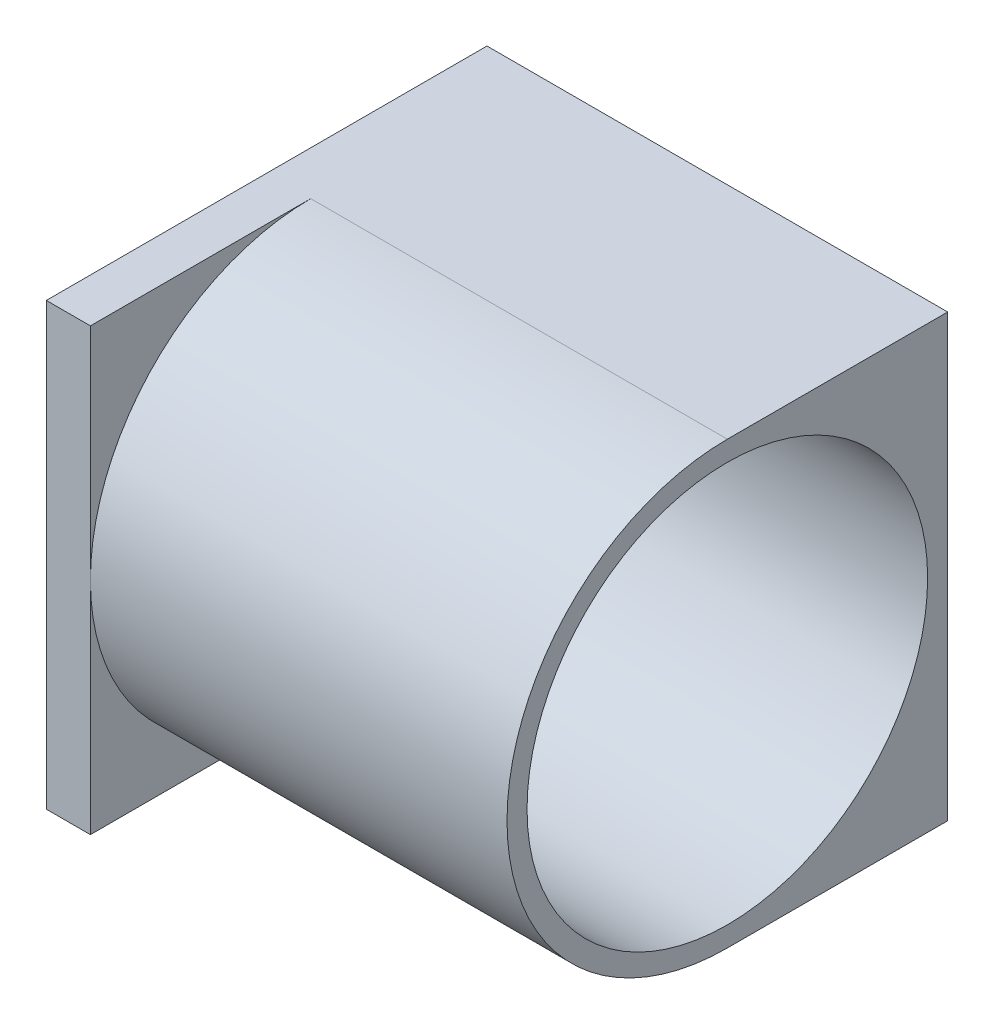
ISO-10303-21;
HEADER;
FILE_DESCRIPTION(('STEP AP214'),'2;1');
FILE_NAME('part.step','',(''),(''),'','','');
FILE_SCHEMA(('AUTOMOTIVE_DESIGN { 1 0 10303 214 1 1 1 1 }'));
ENDSEC;
DATA;
#1=APPLICATION_CONTEXT('core data for automotive mechanical design processes');
#2=APPLICATION_PROTOCOL_DEFINITION('international standard','automotive_design',2000,#1);
#3=PRODUCT_CONTEXT('',#1,'mechanical');
#4=PRODUCT('Part','Part','',(#3));
#5=PRODUCT_RELATED_PRODUCT_CATEGORY('part','',(#4));
#6=PRODUCT_DEFINITION_FORMATION('','',#4);
#7=PRODUCT_DEFINITION_CONTEXT('part definition',#1,'design');
#8=PRODUCT_DEFINITION('design','',#6,#7);
#9=PRODUCT_DEFINITION_SHAPE('','',#8);
#10=(LENGTH_UNIT() NAMED_UNIT(*) SI_UNIT(.MILLI.,.METRE.));
#11=(NAMED_UNIT(*) PLANE_ANGLE_UNIT() SI_UNIT($,.RADIAN.));
#12=(NAMED_UNIT(*) SI_UNIT($,.STERADIAN.) SOLID_ANGLE_UNIT());
#13=UNCERTAINTY_MEASURE_WITH_UNIT(LENGTH_MEASURE(1.E-05),#10,'distance_accuracy_value','');
#14=(GEOMETRIC_REPRESENTATION_CONTEXT(3) GLOBAL_UNCERTAINTY_ASSIGNED_CONTEXT((#13)) GLOBAL_UNIT_ASSIGNED_CONTEXT((#10,
#11,#12)) REPRESENTATION_CONTEXT('',''));
#15=CARTESIAN_POINT('',(0.,0.,0.));
#16=DIRECTION('',(0.,0.,1.));
#17=DIRECTION('',(1.,0.,0.));
#18=AXIS2_PLACEMENT_3D('',#15,#16,#17);
#19=CARTESIAN_POINT('',(0.,0.,0.));
#20=DIRECTION('',(1.,0.,0.));
#21=DIRECTION('',(0.,1.,0.));
#22=AXIS2_PLACEMENT_3D('',#19,#20,#21);
#23=PLANE('',#22);
#24=CARTESIAN_POINT('',(0.,0.,0.));
#25=DIRECTION('',(-1.,0.,0.));
#26=DIRECTION('',(0.,-1.,0.));
#27=AXIS2_PLACEMENT_3D('',#24,#25,#26);
#28=CIRCLE('',#27,50.);
#29=CARTESIAN_POINT('',(0.,50.,0.));
#30=VERTEX_POINT('',#29);
#31=EDGE_CURVE('E20',#30,#30,#28,.T.);
#32=ORIENTED_EDGE('',*,*,#31,.F.);
#33=EDGE_LOOP('',(#32));
#34=FACE_BOUND('',#33,.T.);
#35=DIRECTION('',(0.,0.,1.));
#36=VECTOR('',#35,1.);
#37=CARTESIAN_POINT('',(0.,55.,-55.));
#38=LINE('',#37,#36);
#39=CARTESIAN_POINT('',(0.,55.,-55.));
#40=VERTEX_POINT('',#39);
#41=CARTESIAN_POINT('',(0.,55.,55.));
#42=VERTEX_POINT('',#41);
#43=EDGE_CURVE('E11',#40,#42,#38,.T.);
#44=ORIENTED_EDGE('',*,*,#43,.F.);
#45=DIRECTION('',(0.,1.,0.));
#46=VECTOR('',#45,1.);
#47=CARTESIAN_POINT('',(0.,-55.,-55.));
#48=LINE('',#47,#46);
#49=CARTESIAN_POINT('',(0.,-55.,-55.));
#50=VERTEX_POINT('',#49);
#51=EDGE_CURVE('E104',#50,#40,#48,.T.);
#52=ORIENTED_EDGE('',*,*,#51,.F.);
#53=DIRECTION('',(0.,0.,-1.));
#54=VECTOR('',#53,1.);
#55=CARTESIAN_POINT('',(0.,-55.,55.));
#56=LINE('',#55,#54);
#57=CARTESIAN_POINT('',(0.,-55.,55.));
#58=VERTEX_POINT('',#57);
#59=EDGE_CURVE('E126',#58,#50,#56,.T.);
#60=ORIENTED_EDGE('',*,*,#59,.F.);
#61=DIRECTION('',(0.,-1.,0.));
#62=VECTOR('',#61,1.);
#63=CARTESIAN_POINT('',(0.,55.,55.));
#64=LINE('',#63,#62);
#65=EDGE_CURVE('E129',#42,#58,#64,.T.);
#66=ORIENTED_EDGE('',*,*,#65,.F.);
#67=EDGE_LOOP('',(#44,#52,#60,#66));
#68=FACE_BOUND('',#67,.T.);
#69=ADVANCED_FACE('F16',(#34,#68),#23,.F.);
#70=CARTESIAN_POINT('',(11.,0.,0.));
#71=DIRECTION('',(1.,0.,0.));
#72=DIRECTION('',(0.,1.,0.));
#73=AXIS2_PLACEMENT_3D('',#70,#71,#72);
#74=PLANE('',#73);
#75=CARTESIAN_POINT('',(11.,0.,0.));
#76=DIRECTION('',(-1.,0.,0.));
#77=DIRECTION('',(0.,1.,0.));
#78=AXIS2_PLACEMENT_3D('',#75,#76,#77);
#79=CIRCLE('',#78,55.);
#80=CARTESIAN_POINT('',(11.,-55.,0.));
#81=VERTEX_POINT('',#80);
#82=CARTESIAN_POINT('',(11.,0.,55.));
#83=VERTEX_POINT('',#82);
#84=EDGE_CURVE('E124',#81,#83,#79,.T.);
#85=ORIENTED_EDGE('',*,*,#84,.T.);
#86=DIRECTION('',(0.,-1.,0.));
#87=VECTOR('',#86,1.);
#88=CARTESIAN_POINT('',(11.,55.,55.));
#89=LINE('',#88,#87);
#90=CARTESIAN_POINT('',(11.,-55.,55.));
#91=VERTEX_POINT('',#90);
#92=EDGE_CURVE('E128',#83,#91,#89,.T.);
#93=ORIENTED_EDGE('',*,*,#92,.T.);
#94=DIRECTION('',(0.,0.,-1.));
#95=VECTOR('',#94,1.);
#96=CARTESIAN_POINT('',(11.,-55.,55.));
#97=LINE('',#96,#95);
#98=EDGE_CURVE('E127',#91,#81,#97,.T.);
#99=ORIENTED_EDGE('',*,*,#98,.T.);
#100=EDGE_LOOP('',(#85,#93,#99));
#101=FACE_BOUND('',#100,.T.);
#102=ADVANCED_FACE('F18',(#101),#74,.T.);
#103=CARTESIAN_POINT('',(0.,55.,-55.));
#104=DIRECTION('',(0.,1.,0.));
#105=DIRECTION('',(1.,0.,0.));
#106=AXIS2_PLACEMENT_3D('',#103,#104,#105);
#107=PLANE('',#106);
#108=ORIENTED_EDGE('',*,*,#43,.T.);
#109=DIRECTION('',(1.,0.,0.));
#110=VECTOR('',#109,1.);
#111=CARTESIAN_POINT('',(0.,55.,55.));
#112=LINE('',#111,#110);
#113=CARTESIAN_POINT('',(11.,55.,55.));
#114=VERTEX_POINT('',#113);
#115=EDGE_CURVE('E27',#42,#114,#112,.T.);
#116=ORIENTED_EDGE('',*,*,#115,.T.);
#117=DIRECTION('',(0.,0.,1.));
#118=VECTOR('',#117,1.);
#119=CARTESIAN_POINT('',(11.,55.,-55.));
#120=LINE('',#119,#118);
#121=CARTESIAN_POINT('',(11.,55.,0.));
#122=VERTEX_POINT('',#121);
#123=EDGE_CURVE('E120',#122,#114,#120,.T.);
#124=ORIENTED_EDGE('',*,*,#123,.F.);
#125=DIRECTION('',(1.,0.,0.));
#126=VECTOR('',#125,1.);
#127=CARTESIAN_POINT('',(11.,55.,0.));
#128=LINE('',#127,#126);
#129=CARTESIAN_POINT('',(115.,55.,0.));
#130=VERTEX_POINT('',#129);
#131=EDGE_CURVE('E173',#122,#130,#128,.T.);
#132=ORIENTED_EDGE('',*,*,#131,.T.);
#133=DIRECTION('',(0.,0.,1.));
#134=VECTOR('',#133,1.);
#135=CARTESIAN_POINT('',(115.,55.,-55.));
#136=LINE('',#135,#134);
#137=CARTESIAN_POINT('',(115.,55.,-55.));
#138=VERTEX_POINT('',#137);
#139=EDGE_CURVE('E180',#138,#130,#136,.T.);
#140=ORIENTED_EDGE('',*,*,#139,.F.);
#141=DIRECTION('',(1.,0.,0.));
#142=VECTOR('',#141,1.);
#143=CARTESIAN_POINT('',(0.,55.,-55.));
#144=LINE('',#143,#142);
#145=EDGE_CURVE('E110',#40,#138,#144,.T.);
#146=ORIENTED_EDGE('',*,*,#145,.F.);
#147=EDGE_LOOP('',(#108,#116,#124,#132,#140,#146));
#148=FACE_BOUND('',#147,.T.);
#149=ADVANCED_FACE('F171',(#148),#107,.T.);
#150=CARTESIAN_POINT('',(0.,55.,55.));
#151=DIRECTION('',(0.,0.,1.));
#152=DIRECTION('',(1.,0.,0.));
#153=AXIS2_PLACEMENT_3D('',#150,#151,#152);
#154=PLANE('',#153);
#155=ORIENTED_EDGE('',*,*,#65,.T.);
#156=DIRECTION('',(1.,0.,0.));
#157=VECTOR('',#156,1.);
#158=CARTESIAN_POINT('',(0.,-55.,55.));
#159=LINE('',#158,#157);
#160=EDGE_CURVE('E138',#58,#91,#159,.T.);
#161=ORIENTED_EDGE('',*,*,#160,.T.);
#162=ORIENTED_EDGE('',*,*,#92,.F.);
#163=DIRECTION('',(0.,-1.,0.));
#164=VECTOR('',#163,1.);
#165=CARTESIAN_POINT('',(11.,55.,55.));
#166=LINE('',#165,#164);
#167=EDGE_CURVE('E113',#114,#83,#166,.T.);
#168=ORIENTED_EDGE('',*,*,#167,.F.);
#169=ORIENTED_EDGE('',*,*,#115,.F.);
#170=EDGE_LOOP('',(#155,#161,#162,#168,#169));
#171=FACE_BOUND('',#170,.T.);
#172=ADVANCED_FACE('F207',(#171),#154,.T.);
#173=CARTESIAN_POINT('',(0.,-55.,55.));
#174=DIRECTION('',(0.,-1.,0.));
#175=DIRECTION('',(0.,0.,-1.));
#176=AXIS2_PLACEMENT_3D('',#173,#174,#175);
#177=PLANE('',#176);
#178=ORIENTED_EDGE('',*,*,#59,.T.);
#179=DIRECTION('',(1.,0.,0.));
#180=VECTOR('',#179,1.);
#181=CARTESIAN_POINT('',(0.,-55.,-55.));
#182=LINE('',#181,#180);
#183=CARTESIAN_POINT('',(115.,-55.,-55.));
#184=VERTEX_POINT('',#183);
#185=EDGE_CURVE('E81',#50,#184,#182,.T.);
#186=ORIENTED_EDGE('',*,*,#185,.T.);
#187=DIRECTION('',(0.,0.,-1.));
#188=VECTOR('',#187,1.);
#189=CARTESIAN_POINT('',(115.,-55.,0.));
#190=LINE('',#189,#188);
#191=CARTESIAN_POINT('',(115.,-55.,0.));
#192=VERTEX_POINT('',#191);
#193=EDGE_CURVE('E186',#192,#184,#190,.T.);
#194=ORIENTED_EDGE('',*,*,#193,.F.);
#195=DIRECTION('',(1.,0.,0.));
#196=VECTOR('',#195,1.);
#197=CARTESIAN_POINT('',(11.,-55.,0.));
#198=LINE('',#197,#196);
#199=EDGE_CURVE('E149',#81,#192,#198,.T.);
#200=ORIENTED_EDGE('',*,*,#199,.F.);
#201=ORIENTED_EDGE('',*,*,#98,.F.);
#202=ORIENTED_EDGE('',*,*,#160,.F.);
#203=EDGE_LOOP('',(#178,#186,#194,#200,#201,#202));
#204=FACE_BOUND('',#203,.T.);
#205=ADVANCED_FACE('F204',(#204),#177,.T.);
#206=CARTESIAN_POINT('',(0.,-55.,-55.));
#207=DIRECTION('',(0.,0.,-1.));
#208=DIRECTION('',(0.,-1.,0.));
#209=AXIS2_PLACEMENT_3D('',#206,#207,#208);
#210=PLANE('',#209);
#211=ORIENTED_EDGE('',*,*,#51,.T.);
#212=ORIENTED_EDGE('',*,*,#145,.T.);
#213=DIRECTION('',(0.,1.,0.));
#214=VECTOR('',#213,1.);
#215=CARTESIAN_POINT('',(115.,-55.,-55.));
#216=LINE('',#215,#214);
#217=EDGE_CURVE('E156',#184,#138,#216,.T.);
#218=ORIENTED_EDGE('',*,*,#217,.F.);
#219=ORIENTED_EDGE('',*,*,#185,.F.);
#220=EDGE_LOOP('',(#211,#212,#218,#219));
#221=FACE_BOUND('',#220,.T.);
#222=ADVANCED_FACE('F201',(#221),#210,.T.);
#223=CARTESIAN_POINT('',(0.,0.,0.));
#224=DIRECTION('',(1.,0.,0.));
#225=DIRECTION('',(0.,-1.,0.));
#226=AXIS2_PLACEMENT_3D('',#223,#224,#225);
#227=CYLINDRICAL_SURFACE('',#226,50.);
#228=CARTESIAN_POINT('',(115.,0.,0.));
#229=DIRECTION('',(-1.,0.,0.));
#230=DIRECTION('',(0.,0.,1.));
#231=AXIS2_PLACEMENT_3D('',#228,#229,#230);
#232=CIRCLE('',#231,50.);
#233=CARTESIAN_POINT('',(115.,50.,0.));
#234=VERTEX_POINT('',#233);
#235=EDGE_CURVE('E153',#234,#234,#232,.T.);
#236=ORIENTED_EDGE('',*,*,#235,.F.);
#237=DIRECTION('',(-1.,0.,0.));
#238=VECTOR('',#237,1.);
#239=CARTESIAN_POINT('',(0.,50.,0.));
#240=LINE('',#239,#238);
#241=EDGE_CURVE('E68',#234,#30,#240,.T.);
#242=ORIENTED_EDGE('',*,*,#241,.T.);
#243=ORIENTED_EDGE('',*,*,#31,.T.);
#244=ORIENTED_EDGE('',*,*,#241,.F.);
#245=EDGE_LOOP('',(#236,#242,#243,#244));
#246=FACE_BOUND('',#245,.T.);
#247=ADVANCED_FACE('F101',(#246),#227,.F.);
#248=CARTESIAN_POINT('',(11.,0.,0.));
#249=DIRECTION('',(1.,0.,0.));
#250=DIRECTION('',(0.,1.,0.));
#251=AXIS2_PLACEMENT_3D('',#248,#249,#250);
#252=PLANE('',#251);
#253=CARTESIAN_POINT('',(11.,0.,0.));
#254=DIRECTION('',(-1.,0.,0.));
#255=DIRECTION('',(0.,1.,0.));
#256=AXIS2_PLACEMENT_3D('',#253,#254,#255);
#257=CIRCLE('',#256,55.);
#258=EDGE_CURVE('E168',#83,#122,#257,.T.);
#259=ORIENTED_EDGE('',*,*,#258,.T.);
#260=ORIENTED_EDGE('',*,*,#123,.T.);
#261=ORIENTED_EDGE('',*,*,#167,.T.);
#262=EDGE_LOOP('',(#259,#260,#261));
#263=FACE_BOUND('',#262,.T.);
#264=ADVANCED_FACE('F165',(#263),#252,.T.);
#265=CARTESIAN_POINT('',(115.,0.,0.));
#266=DIRECTION('',(1.,0.,0.));
#267=DIRECTION('',(0.,1.,0.));
#268=AXIS2_PLACEMENT_3D('',#265,#266,#267);
#269=PLANE('',#268);
#270=ORIENTED_EDGE('',*,*,#235,.T.);
#271=EDGE_LOOP('',(#270));
#272=FACE_BOUND('',#271,.T.);
#273=ORIENTED_EDGE('',*,*,#139,.T.);
#274=CARTESIAN_POINT('',(115.,0.,0.));
#275=DIRECTION('',(1.,0.,0.));
#276=DIRECTION('',(0.,1.,0.));
#277=AXIS2_PLACEMENT_3D('',#274,#275,#276);
#278=CIRCLE('',#277,55.);
#279=EDGE_CURVE('E152',#130,#192,#278,.T.);
#280=ORIENTED_EDGE('',*,*,#279,.T.);
#281=ORIENTED_EDGE('',*,*,#193,.T.);
#282=ORIENTED_EDGE('',*,*,#217,.T.);
#283=EDGE_LOOP('',(#273,#280,#281,#282));
#284=FACE_BOUND('',#283,.T.);
#285=ADVANCED_FACE('F196',(#272,#284),#269,.T.);
#286=CARTESIAN_POINT('',(11.,0.,0.));
#287=DIRECTION('',(1.,0.,0.));
#288=DIRECTION('',(0.,1.,0.));
#289=AXIS2_PLACEMENT_3D('',#286,#287,#288);
#290=CYLINDRICAL_SURFACE('',#289,55.);
#291=ORIENTED_EDGE('',*,*,#258,.F.);
#292=ORIENTED_EDGE('',*,*,#84,.F.);
#293=ORIENTED_EDGE('',*,*,#199,.T.);
#294=ORIENTED_EDGE('',*,*,#279,.F.);
#295=ORIENTED_EDGE('',*,*,#131,.F.);
#296=EDGE_LOOP('',(#291,#292,#293,#294,#295));
#297=FACE_BOUND('',#296,.T.);
#298=ADVANCED_FACE('F176',(#297),#290,.T.);
#299=CLOSED_SHELL('',(#69,#102,#149,#172,#205,#222,#247,#264,#285,#298));
#300=MANIFOLD_SOLID_BREP('B1',#299);
#301=ADVANCED_BREP_SHAPE_REPRESENTATION('',(#18,#300),#14);
#302=SHAPE_DEFINITION_REPRESENTATION(#9,#301);
ENDSEC;
END-ISO-10303-21;
